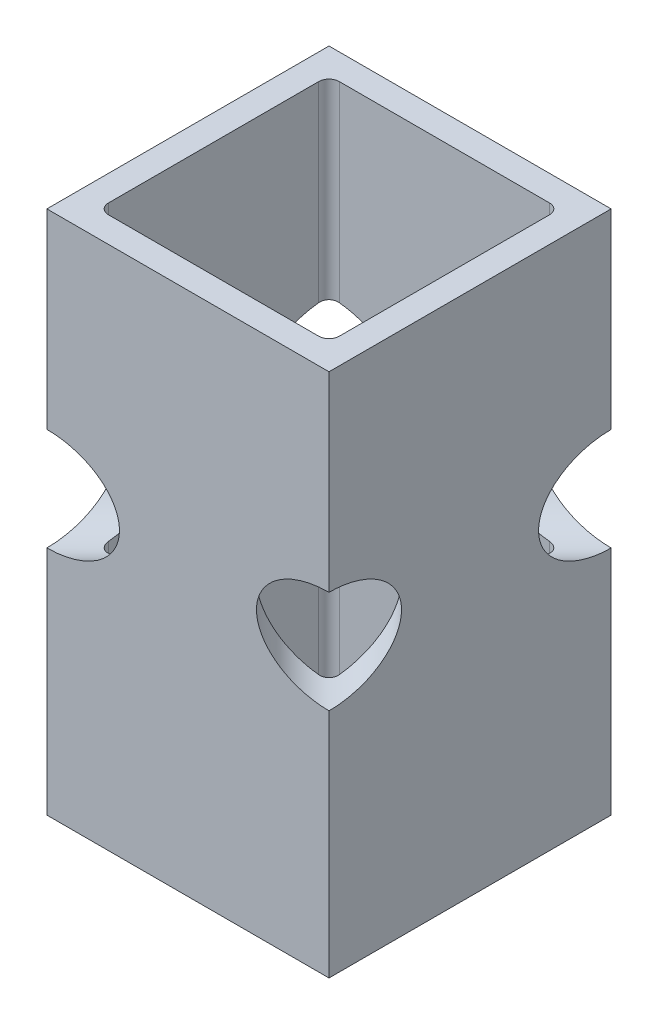
ISO-10303-21;
HEADER;
FILE_DESCRIPTION(('STEP AP214'),'2;1');
FILE_NAME('part.step','',(''),(''),'','','');
FILE_SCHEMA(('AUTOMOTIVE_DESIGN { 1 0 10303 214 1 1 1 1 }'));
ENDSEC;
DATA;
#1=APPLICATION_CONTEXT('core data for automotive mechanical design processes');
#2=APPLICATION_PROTOCOL_DEFINITION('international standard','automotive_design',2000,#1);
#3=PRODUCT_CONTEXT('',#1,'mechanical');
#4=PRODUCT('Part','Part','',(#3));
#5=PRODUCT_RELATED_PRODUCT_CATEGORY('part','',(#4));
#6=PRODUCT_DEFINITION_FORMATION('','',#4);
#7=PRODUCT_DEFINITION_CONTEXT('part definition',#1,'design');
#8=PRODUCT_DEFINITION('design','',#6,#7);
#9=PRODUCT_DEFINITION_SHAPE('','',#8);
#10=(LENGTH_UNIT() NAMED_UNIT(*) SI_UNIT(.MILLI.,.METRE.));
#11=(NAMED_UNIT(*) PLANE_ANGLE_UNIT() SI_UNIT($,.RADIAN.));
#12=(NAMED_UNIT(*) SI_UNIT($,.STERADIAN.) SOLID_ANGLE_UNIT());
#13=UNCERTAINTY_MEASURE_WITH_UNIT(LENGTH_MEASURE(1.E-05),#10,'distance_accuracy_value','');
#14=(GEOMETRIC_REPRESENTATION_CONTEXT(3) GLOBAL_UNCERTAINTY_ASSIGNED_CONTEXT((#13)) GLOBAL_UNIT_ASSIGNED_CONTEXT((#10,
#11,#12)) REPRESENTATION_CONTEXT('',''));
#15=CARTESIAN_POINT('',(0.,0.,0.));
#16=DIRECTION('',(0.,0.,1.));
#17=DIRECTION('',(1.,0.,0.));
#18=AXIS2_PLACEMENT_3D('',#15,#16,#17);
#19=CARTESIAN_POINT('',(13.0175,65.,13.0175));
#20=DIRECTION('',(0.,1.,0.));
#21=DIRECTION('',(0.,0.,1.));
#22=AXIS2_PLACEMENT_3D('',#19,#20,#21);
#23=CYLINDRICAL_SURFACE('',#22,1.27);
#24=DIRECTION('',(0.,-1.,0.));
#25=VECTOR('',#24,1.);
#26=CARTESIAN_POINT('',(14.2875,65.,13.0175));
#27=LINE('',#26,#25);
#28=CARTESIAN_POINT('',(14.2875,41.2861792847484,13.0175));
#29=VERTEX_POINT('',#28);
#30=CARTESIAN_POINT('',(14.2875,65.,13.0175));
#31=VERTEX_POINT('',#30);
#32=EDGE_CURVE('E259',#29,#31,#27,.F.);
#33=ORIENTED_EDGE('',*,*,#32,.F.);
#34=CARTESIAN_POINT('',(14.2875,41.2861792847484,13.0175));
#35=CARTESIAN_POINT('',(14.2874992650252,41.2897753053756,13.053097915007));
#36=CARTESIAN_POINT('',(14.2860023741304,41.2933662752337,13.0886794350228));
#37=CARTESIAN_POINT('',(14.2800272231778,41.3004426344767,13.1596024855031));
#38=CARTESIAN_POINT('',(14.2755488986464,41.3039280215768,13.194944010761));
#39=CARTESIAN_POINT('',(14.257669029886,41.3140762505206,13.3002322041436));
#40=CARTESIAN_POINT('',(14.2398225448024,41.3204379822199,13.3695073681853));
#41=CARTESIAN_POINT('',(14.1927035864845,41.3316400183867,13.5042229008832));
#42=CARTESIAN_POINT('',(14.1634211945816,41.3364789955315,13.5696598837603));
#43=CARTESIAN_POINT('',(14.0942210454631,41.3440868410946,13.6947552121595));
#44=CARTESIAN_POINT('',(14.0543085199653,41.3468567252913,13.7544163806604));
#45=CARTESIAN_POINT('',(13.9655438158698,41.3499943278115,13.8655006465901));
#46=CARTESIAN_POINT('',(13.9168109876824,41.3503919614329,13.9170183252224));
#47=CARTESIAN_POINT('',(13.811471668528,41.3488208732778,14.0112312214346));
#48=CARTESIAN_POINT('',(13.7548638613512,41.3468517555054,14.053924961226));
#49=CARTESIAN_POINT('',(13.6359198442812,41.340791069684,14.1289695479802));
#50=CARTESIAN_POINT('',(13.5736334334685,41.3367167205146,14.1614009134513));
#51=CARTESIAN_POINT('',(13.4446928552833,41.3268960472698,14.2155361933771));
#52=CARTESIAN_POINT('',(13.3780400684717,41.321150249715,14.2372434802069));
#53=CARTESIAN_POINT('',(13.2621705153789,41.3104491947401,14.2646850359202));
#54=CARTESIAN_POINT('',(13.2135758489815,41.3057566257393,14.273237165521));
#55=CARTESIAN_POINT('',(13.1158258334415,41.2961059503237,14.2846436569724));
#56=CARTESIAN_POINT('',(13.0666714774751,41.2911482696659,14.2875068885268));
#57=CARTESIAN_POINT('',(13.0175,41.2861792847484,14.2875));
#58=B_SPLINE_CURVE_WITH_KNOTS('',3,(#34,#35,#36,#37,#38,#39,#40,#41,#42,#43,#44,#45,#46,#47,#48,
#49,#50,#51,#52,#53,#54,#55,#56,#57),.UNSPECIFIED.,.F.,.F.,(4,2,2,2,2,2,2,2,2,2,2,4),(0.,
0.107272353476896,0.214547026794335,0.428903122119667,0.64344554860997,0.85788258057257,
1.06960963742599,1.28137212457303,1.49142937798506,1.70142053308292,1.84979912914096,
1.99794620229393),.UNSPECIFIED.);
#59=CARTESIAN_POINT('',(13.0175,41.2861792847484,14.2875));
#60=VERTEX_POINT('',#59);
#61=EDGE_CURVE('E451',#29,#60,#58,.T.);
#62=ORIENTED_EDGE('',*,*,#61,.T.);
#63=DIRECTION('',(0.,-1.,0.));
#64=VECTOR('',#63,1.);
#65=CARTESIAN_POINT('',(13.0175,0.,14.2875));
#66=LINE('',#65,#64);
#67=CARTESIAN_POINT('',(13.0175,65.,14.2875));
#68=VERTEX_POINT('',#67);
#69=EDGE_CURVE('E251',#68,#60,#66,.T.);
#70=ORIENTED_EDGE('',*,*,#69,.F.);
#71=CARTESIAN_POINT('',(13.0175,65.,13.0175));
#72=DIRECTION('',(0.,1.,0.));
#73=DIRECTION('',(0.,0.,1.));
#74=AXIS2_PLACEMENT_3D('',#71,#72,#73);
#75=CIRCLE('',#74,1.27);
#76=EDGE_CURVE('E282',#31,#68,#75,.F.);
#77=ORIENTED_EDGE('',*,*,#76,.F.);
#78=EDGE_LOOP('',(#33,#62,#70,#77));
#79=FACE_BOUND('',#78,.T.);
#80=ADVANCED_FACE('F41',(#79),#23,.F.);
#81=CARTESIAN_POINT('',(-13.0175,65.,-13.0175));
#82=DIRECTION('',(0.,1.,0.));
#83=DIRECTION('',(0.,0.,1.));
#84=AXIS2_PLACEMENT_3D('',#81,#82,#83);
#85=CYLINDRICAL_SURFACE('',#84,1.27);
#86=DIRECTION('',(0.,-1.,0.));
#87=VECTOR('',#86,1.);
#88=CARTESIAN_POINT('',(-14.2875,65.,-13.0175));
#89=LINE('',#88,#87);
#90=CARTESIAN_POINT('',(-14.2875,41.2861792847484,-13.0175));
#91=VERTEX_POINT('',#90);
#92=CARTESIAN_POINT('',(-14.2875,65.,-13.0175));
#93=VERTEX_POINT('',#92);
#94=EDGE_CURVE('E263',#91,#93,#89,.F.);
#95=ORIENTED_EDGE('',*,*,#94,.F.);
#96=CARTESIAN_POINT('',(-14.2875,41.2861792847484,-13.0175));
#97=CARTESIAN_POINT('',(-14.2874992650252,41.2897753053756,-13.053097915007));
#98=CARTESIAN_POINT('',(-14.2860023741304,41.2933662752337,-13.0886794350228));
#99=CARTESIAN_POINT('',(-14.2800272231778,41.3004426344767,-13.1596024855031));
#100=CARTESIAN_POINT('',(-14.2755488986464,41.3039280215768,-13.194944010761));
#101=CARTESIAN_POINT('',(-14.257669029886,41.3140762505206,-13.3002322041436));
#102=CARTESIAN_POINT('',(-14.2398225448024,41.3204379822199,-13.3695073681853));
#103=CARTESIAN_POINT('',(-14.1927035864845,41.3316400183867,-13.5042229008832));
#104=CARTESIAN_POINT('',(-14.1634211945816,41.3364789955315,-13.5696598837603));
#105=CARTESIAN_POINT('',(-14.0942210454631,41.3440868410946,-13.6947552121595));
#106=CARTESIAN_POINT('',(-14.0543085199653,41.3468567252913,-13.7544163806604));
#107=CARTESIAN_POINT('',(-13.9655438158698,41.3499943278115,-13.8655006465901));
#108=CARTESIAN_POINT('',(-13.9168109876824,41.3503919614329,-13.9170183252224));
#109=CARTESIAN_POINT('',(-13.811471668528,41.3488208732778,-14.0112312214346));
#110=CARTESIAN_POINT('',(-13.7548638613512,41.3468517555054,-14.053924961226));
#111=CARTESIAN_POINT('',(-13.6359198442812,41.340791069684,-14.1289695479802));
#112=CARTESIAN_POINT('',(-13.5736334334685,41.3367167205146,-14.1614009134513));
#113=CARTESIAN_POINT('',(-13.4446928552833,41.3268960472698,-14.2155361933771));
#114=CARTESIAN_POINT('',(-13.3780400684717,41.321150249715,-14.2372434802069));
#115=CARTESIAN_POINT('',(-13.2621705153789,41.3104491947401,-14.2646850359202));
#116=CARTESIAN_POINT('',(-13.2135758489815,41.3057566257393,-14.273237165521));
#117=CARTESIAN_POINT('',(-13.1158258334415,41.2961059503237,-14.2846436569724));
#118=CARTESIAN_POINT('',(-13.0666714774751,41.2911482696659,-14.2875068885268));
#119=CARTESIAN_POINT('',(-13.0175,41.2861792847484,-14.2875));
#120=B_SPLINE_CURVE_WITH_KNOTS('',3,(#96,#97,#98,#99,#100,#101,#102,#103,#104,#105,#106,#107,
#108,#109,#110,#111,#112,#113,#114,#115,#116,#117,#118,#119),.UNSPECIFIED.,.F.,.F.,(4,2,2,2,2,2,
2,2,2,2,2,4),(0.,0.107272353476896,0.214547026794335,0.428903122119667,0.643445548609971,
0.85788258057257,1.06960963742599,1.28137212457303,1.49142937798506,1.70142053308292,
1.84979912914096,1.99794620229393),.UNSPECIFIED.);
#121=CARTESIAN_POINT('',(-13.0175,41.2861792847484,-14.2875));
#122=VERTEX_POINT('',#121);
#123=EDGE_CURVE('E11',#91,#122,#120,.T.);
#124=ORIENTED_EDGE('',*,*,#123,.T.);
#125=DIRECTION('',(0.,-1.,0.));
#126=VECTOR('',#125,1.);
#127=CARTESIAN_POINT('',(-13.0175,0.,-14.2875));
#128=LINE('',#127,#126);
#129=CARTESIAN_POINT('',(-13.0175,65.,-14.2875));
#130=VERTEX_POINT('',#129);
#131=EDGE_CURVE('E277',#130,#122,#128,.T.);
#132=ORIENTED_EDGE('',*,*,#131,.F.);
#133=CARTESIAN_POINT('',(-13.0175,65.,-13.0175));
#134=DIRECTION('',(0.,1.,0.));
#135=DIRECTION('',(0.,0.,1.));
#136=AXIS2_PLACEMENT_3D('',#133,#134,#135);
#137=CIRCLE('',#136,1.27);
#138=EDGE_CURVE('E292',#93,#130,#137,.F.);
#139=ORIENTED_EDGE('',*,*,#138,.F.);
#140=EDGE_LOOP('',(#95,#124,#132,#139));
#141=FACE_BOUND('',#140,.T.);
#142=ADVANCED_FACE('F541',(#141),#85,.F.);
#143=CARTESIAN_POINT('',(-13.0175,65.,13.0175));
#144=DIRECTION('',(0.,-1.,0.));
#145=DIRECTION('',(0.,0.,-1.));
#146=AXIS2_PLACEMENT_3D('',#143,#144,#145);
#147=CYLINDRICAL_SURFACE('',#146,1.27);
#148=DIRECTION('',(0.,-1.,0.));
#149=VECTOR('',#148,1.);
#150=CARTESIAN_POINT('',(-14.2875,65.,13.0175));
#151=LINE('',#150,#149);
#152=CARTESIAN_POINT('',(-14.2875,28.7138207152516,13.0175));
#153=VERTEX_POINT('',#152);
#154=CARTESIAN_POINT('',(-14.2875,0.,13.0175));
#155=VERTEX_POINT('',#154);
#156=EDGE_CURVE('E267',#153,#155,#151,.T.);
#157=ORIENTED_EDGE('',*,*,#156,.F.);
#158=CARTESIAN_POINT('',(-14.2875,28.7138207152516,13.0175));
#159=CARTESIAN_POINT('',(-14.2874992650252,28.7102246946244,13.053097915007));
#160=CARTESIAN_POINT('',(-14.2860023741304,28.7066337247663,13.0886794350228));
#161=CARTESIAN_POINT('',(-14.2800272231778,28.6995573655233,13.1596024855031));
#162=CARTESIAN_POINT('',(-14.2755488986464,28.6960719784232,13.194944010761));
#163=CARTESIAN_POINT('',(-14.257669029886,28.6859237494794,13.3002322041436));
#164=CARTESIAN_POINT('',(-14.2398225448024,28.6795620177801,13.3695073681853));
#165=CARTESIAN_POINT('',(-14.1927035864845,28.6683599816133,13.5042229008832));
#166=CARTESIAN_POINT('',(-14.1634211945816,28.6635210044685,13.5696598837603));
#167=CARTESIAN_POINT('',(-14.0942210454631,28.6559131589055,13.6947552121595));
#168=CARTESIAN_POINT('',(-14.0543085199653,28.6531432747087,13.7544163806604));
#169=CARTESIAN_POINT('',(-13.9655438158698,28.6500056721885,13.8655006465902));
#170=CARTESIAN_POINT('',(-13.9168109876824,28.6496080385671,13.9170183252224));
#171=CARTESIAN_POINT('',(-13.811471668528,28.6511791267222,14.0112312214346));
#172=CARTESIAN_POINT('',(-13.7548638613512,28.6531482444946,14.053924961226));
#173=CARTESIAN_POINT('',(-13.6359198442812,28.659208930316,14.1289695479802));
#174=CARTESIAN_POINT('',(-13.5736334334685,28.6632832794854,14.1614009134513));
#175=CARTESIAN_POINT('',(-13.4446928552833,28.6731039527302,14.2155361933771));
#176=CARTESIAN_POINT('',(-13.3780400684717,28.678849750285,14.2372434802069));
#177=CARTESIAN_POINT('',(-13.2621705153789,28.6895508052599,14.2646850359202));
#178=CARTESIAN_POINT('',(-13.2135758489815,28.6942433742607,14.273237165521));
#179=CARTESIAN_POINT('',(-13.1158258334415,28.7038940496763,14.2846436569724));
#180=CARTESIAN_POINT('',(-13.0666714774751,28.7088517303341,14.2875068885268));
#181=CARTESIAN_POINT('',(-13.0175,28.7138207152516,14.2875));
#182=B_SPLINE_CURVE_WITH_KNOTS('',3,(#158,#159,#160,#161,#162,#163,#164,#165,#166,#167,#168,
#169,#170,#171,#172,#173,#174,#175,#176,#177,#178,#179,#180,#181),.UNSPECIFIED.,.F.,.F.,(4,2,2,
2,2,2,2,2,2,2,2,4),(0.,0.107272353476896,0.214547026794334,0.428903122119667,0.643445548609973,
0.857882580572572,1.069609637426,1.28137212457303,1.49142937798506,1.70142053308292,
1.84979912914097,1.99794620229393),.UNSPECIFIED.);
#183=CARTESIAN_POINT('',(-13.0175,28.7138207152516,14.2875));
#184=VERTEX_POINT('',#183);
#185=EDGE_CURVE('E351',#153,#184,#182,.T.);
#186=ORIENTED_EDGE('',*,*,#185,.T.);
#187=DIRECTION('',(0.,-1.,0.));
#188=VECTOR('',#187,1.);
#189=CARTESIAN_POINT('',(-13.0175,65.,14.2875));
#190=LINE('',#189,#188);
#191=CARTESIAN_POINT('',(-13.0175,0.,14.2875));
#192=VERTEX_POINT('',#191);
#193=EDGE_CURVE('E246',#192,#184,#190,.F.);
#194=ORIENTED_EDGE('',*,*,#193,.F.);
#195=CARTESIAN_POINT('',(-13.0175,0.,13.0175));
#196=DIRECTION('',(0.,1.,0.));
#197=DIRECTION('',(0.,0.,1.));
#198=AXIS2_PLACEMENT_3D('',#195,#196,#197);
#199=CIRCLE('',#198,1.27);
#200=EDGE_CURVE('E284',#155,#192,#199,.T.);
#201=ORIENTED_EDGE('',*,*,#200,.F.);
#202=EDGE_LOOP('',(#157,#186,#194,#201));
#203=FACE_BOUND('',#202,.T.);
#204=ADVANCED_FACE('F346',(#203),#147,.F.);
#205=CARTESIAN_POINT('',(13.0175,65.,-13.0175));
#206=DIRECTION('',(0.,-1.,0.));
#207=DIRECTION('',(0.,0.,-1.));
#208=AXIS2_PLACEMENT_3D('',#205,#206,#207);
#209=CYLINDRICAL_SURFACE('',#208,1.27);
#210=DIRECTION('',(0.,-1.,0.));
#211=VECTOR('',#210,1.);
#212=CARTESIAN_POINT('',(14.2875,65.,-13.0175));
#213=LINE('',#212,#211);
#214=CARTESIAN_POINT('',(14.2875,28.7138207152516,-13.0175));
#215=VERTEX_POINT('',#214);
#216=CARTESIAN_POINT('',(14.2875,0.,-13.0175));
#217=VERTEX_POINT('',#216);
#218=EDGE_CURVE('E255',#215,#217,#213,.T.);
#219=ORIENTED_EDGE('',*,*,#218,.F.);
#220=CARTESIAN_POINT('',(14.2875,28.7138207152516,-13.0175));
#221=CARTESIAN_POINT('',(14.2874992650252,28.7102246946244,-13.053097915007));
#222=CARTESIAN_POINT('',(14.2860023741304,28.7066337247663,-13.0886794350228));
#223=CARTESIAN_POINT('',(14.2800272231778,28.6995573655233,-13.1596024855031));
#224=CARTESIAN_POINT('',(14.2755488986464,28.6960719784232,-13.194944010761));
#225=CARTESIAN_POINT('',(14.257669029886,28.6859237494794,-13.3002322041436));
#226=CARTESIAN_POINT('',(14.2398225448024,28.6795620177801,-13.3695073681853));
#227=CARTESIAN_POINT('',(14.1927035864845,28.6683599816133,-13.5042229008832));
#228=CARTESIAN_POINT('',(14.1634211945816,28.6635210044685,-13.5696598837603));
#229=CARTESIAN_POINT('',(14.0942210454631,28.6559131589055,-13.6947552121595));
#230=CARTESIAN_POINT('',(14.0543085199653,28.6531432747087,-13.7544163806604));
#231=CARTESIAN_POINT('',(13.9655438158698,28.6500056721885,-13.8655006465902));
#232=CARTESIAN_POINT('',(13.9168109876824,28.6496080385671,-13.9170183252224));
#233=CARTESIAN_POINT('',(13.811471668528,28.6511791267222,-14.0112312214346));
#234=CARTESIAN_POINT('',(13.7548638613512,28.6531482444946,-14.053924961226));
#235=CARTESIAN_POINT('',(13.6359198442812,28.659208930316,-14.1289695479802));
#236=CARTESIAN_POINT('',(13.5736334334685,28.6632832794854,-14.1614009134513));
#237=CARTESIAN_POINT('',(13.4446928552833,28.6731039527302,-14.2155361933771));
#238=CARTESIAN_POINT('',(13.3780400684717,28.678849750285,-14.2372434802069));
#239=CARTESIAN_POINT('',(13.2621705153789,28.6895508052599,-14.2646850359202));
#240=CARTESIAN_POINT('',(13.2135758489815,28.6942433742607,-14.273237165521));
#241=CARTESIAN_POINT('',(13.1158258334415,28.7038940496763,-14.2846436569724));
#242=CARTESIAN_POINT('',(13.0666714774751,28.7088517303341,-14.2875068885268));
#243=CARTESIAN_POINT('',(13.0175,28.7138207152516,-14.2875));
#244=B_SPLINE_CURVE_WITH_KNOTS('',3,(#220,#221,#222,#223,#224,#225,#226,#227,#228,#229,#230,
#231,#232,#233,#234,#235,#236,#237,#238,#239,#240,#241,#242,#243),.UNSPECIFIED.,.F.,.F.,(4,2,2,
2,2,2,2,2,2,2,2,4),(0.,0.107272353476896,0.214547026794334,0.428903122119667,0.643445548609972,
0.857882580572571,1.06960963742599,1.28137212457303,1.49142937798506,1.70142053308292,
1.84979912914097,1.99794620229393),.UNSPECIFIED.);
#245=CARTESIAN_POINT('',(13.0175,28.7138207152516,-14.2875));
#246=VERTEX_POINT('',#245);
#247=EDGE_CURVE('E306',#215,#246,#244,.T.);
#248=ORIENTED_EDGE('',*,*,#247,.T.);
#249=DIRECTION('',(0.,-1.,0.));
#250=VECTOR('',#249,1.);
#251=CARTESIAN_POINT('',(13.0175,65.,-14.2875));
#252=LINE('',#251,#250);
#253=CARTESIAN_POINT('',(13.0175,0.,-14.2875));
#254=VERTEX_POINT('',#253);
#255=EDGE_CURVE('E273',#254,#246,#252,.F.);
#256=ORIENTED_EDGE('',*,*,#255,.F.);
#257=CARTESIAN_POINT('',(13.0175,0.,-13.0175));
#258=DIRECTION('',(0.,1.,0.));
#259=DIRECTION('',(0.,0.,1.));
#260=AXIS2_PLACEMENT_3D('',#257,#258,#259);
#261=CIRCLE('',#260,1.27);
#262=EDGE_CURVE('E294',#217,#254,#261,.T.);
#263=ORIENTED_EDGE('',*,*,#262,.F.);
#264=EDGE_LOOP('',(#219,#248,#256,#263));
#265=FACE_BOUND('',#264,.T.);
#266=ADVANCED_FACE('F475',(#265),#209,.F.);
#267=CARTESIAN_POINT('',(-14.2875,65.,0.));
#268=DIRECTION('',(1.,0.,0.));
#269=DIRECTION('',(0.,0.,-1.));
#270=AXIS2_PLACEMENT_3D('',#267,#268,#269);
#271=PLANE('',#270);
#272=CARTESIAN_POINT('',(-14.2875,35.,-14.2875));
#273=DIRECTION('',(1.,0.,0.));
#274=DIRECTION('',(0.,0.,1.));
#275=AXIS2_PLACEMENT_3D('',#272,#273,#274);
#276=ELLIPSE('',#275,8.98025612106916,6.35);
#277=CARTESIAN_POINT('',(-14.2875,28.7138207152516,-13.0175));
#278=VERTEX_POINT('',#277);
#279=EDGE_CURVE('E496',#91,#278,#276,.T.);
#280=ORIENTED_EDGE('',*,*,#279,.F.);
#281=ORIENTED_EDGE('',*,*,#94,.T.);
#282=DIRECTION('',(0.,0.,1.));
#283=VECTOR('',#282,1.);
#284=CARTESIAN_POINT('',(-14.2875,65.,0.));
#285=LINE('',#284,#283);
#286=CARTESIAN_POINT('',(-14.2875,65.,13.0175));
#287=VERTEX_POINT('',#286);
#288=EDGE_CURVE('E385',#93,#287,#285,.T.);
#289=ORIENTED_EDGE('',*,*,#288,.T.);
#290=CARTESIAN_POINT('',(-14.2875,41.2861792847484,13.0175));
#291=VERTEX_POINT('',#290);
#292=EDGE_CURVE('E268',#287,#291,#151,.T.);
#293=ORIENTED_EDGE('',*,*,#292,.T.);
#294=CARTESIAN_POINT('',(-14.2875,35.,14.2875));
#295=DIRECTION('',(1.,0.,0.));
#296=DIRECTION('',(0.,0.,1.));
#297=AXIS2_PLACEMENT_3D('',#294,#295,#296);
#298=ELLIPSE('',#297,8.98025612106916,6.35);
#299=EDGE_CURVE('E360',#153,#291,#298,.T.);
#300=ORIENTED_EDGE('',*,*,#299,.F.);
#301=ORIENTED_EDGE('',*,*,#156,.T.);
#302=DIRECTION('',(0.,0.,1.));
#303=VECTOR('',#302,1.);
#304=CARTESIAN_POINT('',(-14.2875,0.,0.));
#305=LINE('',#304,#303);
#306=CARTESIAN_POINT('',(-14.2875,0.,-13.0175));
#307=VERTEX_POINT('',#306);
#308=EDGE_CURVE('E412',#307,#155,#305,.T.);
#309=ORIENTED_EDGE('',*,*,#308,.F.);
#310=EDGE_CURVE('E264',#307,#278,#89,.F.);
#311=ORIENTED_EDGE('',*,*,#310,.T.);
#312=EDGE_LOOP('',(#280,#281,#289,#293,#300,#301,#309,#311));
#313=FACE_BOUND('',#312,.T.);
#314=ADVANCED_FACE('F530',(#313),#271,.T.);
#315=CARTESIAN_POINT('',(0.,65.,-14.2875));
#316=DIRECTION('',(0.,0.,1.));
#317=DIRECTION('',(1.,0.,0.));
#318=AXIS2_PLACEMENT_3D('',#315,#316,#317);
#319=PLANE('',#318);
#320=CARTESIAN_POINT('',(-14.2875,35.,-14.2875));
#321=DIRECTION('',(0.,0.,1.));
#322=DIRECTION('',(1.,0.,0.));
#323=AXIS2_PLACEMENT_3D('',#320,#321,#322);
#324=ELLIPSE('',#323,8.98025612106916,6.35);
#325=CARTESIAN_POINT('',(-13.0175,28.7138207152516,-14.2875));
#326=VERTEX_POINT('',#325);
#327=EDGE_CURVE('E499',#326,#122,#324,.T.);
#328=ORIENTED_EDGE('',*,*,#327,.F.);
#329=CARTESIAN_POINT('',(-13.0175,0.,-14.2875));
#330=VERTEX_POINT('',#329);
#331=EDGE_CURVE('E276',#326,#330,#128,.T.);
#332=ORIENTED_EDGE('',*,*,#331,.T.);
#333=DIRECTION('',(-1.,0.,0.));
#334=VECTOR('',#333,1.);
#335=CARTESIAN_POINT('',(0.,0.,-14.2875));
#336=LINE('',#335,#334);
#337=EDGE_CURVE('E416',#254,#330,#336,.T.);
#338=ORIENTED_EDGE('',*,*,#337,.F.);
#339=ORIENTED_EDGE('',*,*,#255,.T.);
#340=CARTESIAN_POINT('',(14.2875,35.,-14.2875));
#341=DIRECTION('',(0.,0.,1.));
#342=DIRECTION('',(-1.,0.,0.));
#343=AXIS2_PLACEMENT_3D('',#340,#341,#342);
#344=ELLIPSE('',#343,8.98025612106916,6.35);
#345=CARTESIAN_POINT('',(13.0175,41.2861792847484,-14.2875));
#346=VERTEX_POINT('',#345);
#347=EDGE_CURVE('E336',#346,#246,#344,.T.);
#348=ORIENTED_EDGE('',*,*,#347,.F.);
#349=CARTESIAN_POINT('',(13.0175,65.,-14.2875));
#350=VERTEX_POINT('',#349);
#351=EDGE_CURVE('E272',#346,#350,#252,.F.);
#352=ORIENTED_EDGE('',*,*,#351,.T.);
#353=DIRECTION('',(-1.,0.,0.));
#354=VECTOR('',#353,1.);
#355=CARTESIAN_POINT('',(0.,65.,-14.2875));
#356=LINE('',#355,#354);
#357=EDGE_CURVE('E389',#350,#130,#356,.T.);
#358=ORIENTED_EDGE('',*,*,#357,.T.);
#359=ORIENTED_EDGE('',*,*,#131,.T.);
#360=EDGE_LOOP('',(#328,#332,#338,#339,#348,#352,#358,#359));
#361=FACE_BOUND('',#360,.T.);
#362=ADVANCED_FACE('F479',(#361),#319,.T.);
#363=CARTESIAN_POINT('',(14.2875,65.,0.));
#364=DIRECTION('',(1.,0.,0.));
#365=DIRECTION('',(0.,0.,-1.));
#366=AXIS2_PLACEMENT_3D('',#363,#364,#365);
#367=PLANE('',#366);
#368=CARTESIAN_POINT('',(14.2875,0.,13.0175));
#369=VERTEX_POINT('',#368);
#370=CARTESIAN_POINT('',(14.2875,28.7138207152516,13.0175));
#371=VERTEX_POINT('',#370);
#372=EDGE_CURVE('E260',#369,#371,#27,.F.);
#373=ORIENTED_EDGE('',*,*,#372,.T.);
#374=CARTESIAN_POINT('',(14.2875,35.,14.2875));
#375=DIRECTION('',(1.,0.,0.));
#376=DIRECTION('',(0.,0.,1.));
#377=AXIS2_PLACEMENT_3D('',#374,#375,#376);
#378=ELLIPSE('',#377,8.98025612106916,6.35);
#379=EDGE_CURVE('E458',#371,#29,#378,.T.);
#380=ORIENTED_EDGE('',*,*,#379,.T.);
#381=ORIENTED_EDGE('',*,*,#32,.T.);
#382=DIRECTION('',(0.,0.,1.));
#383=VECTOR('',#382,1.);
#384=CARTESIAN_POINT('',(14.2875,65.,0.));
#385=LINE('',#384,#383);
#386=CARTESIAN_POINT('',(14.2875,65.,-13.0175));
#387=VERTEX_POINT('',#386);
#388=EDGE_CURVE('E392',#387,#31,#385,.T.);
#389=ORIENTED_EDGE('',*,*,#388,.F.);
#390=CARTESIAN_POINT('',(14.2875,41.2861792847484,-13.0175));
#391=VERTEX_POINT('',#390);
#392=EDGE_CURVE('E256',#387,#391,#213,.T.);
#393=ORIENTED_EDGE('',*,*,#392,.T.);
#394=CARTESIAN_POINT('',(14.2875,35.,-14.2875));
#395=DIRECTION('',(1.,0.,0.));
#396=DIRECTION('',(0.,0.,1.));
#397=AXIS2_PLACEMENT_3D('',#394,#395,#396);
#398=ELLIPSE('',#397,8.98025612106916,6.35);
#399=EDGE_CURVE('E231',#391,#215,#398,.T.);
#400=ORIENTED_EDGE('',*,*,#399,.T.);
#401=ORIENTED_EDGE('',*,*,#218,.T.);
#402=DIRECTION('',(0.,0.,1.));
#403=VECTOR('',#402,1.);
#404=CARTESIAN_POINT('',(14.2875,0.,0.));
#405=LINE('',#404,#403);
#406=EDGE_CURVE('E419',#217,#369,#405,.T.);
#407=ORIENTED_EDGE('',*,*,#406,.T.);
#408=EDGE_LOOP('',(#373,#380,#381,#389,#393,#400,#401,#407));
#409=FACE_BOUND('',#408,.T.);
#410=ADVANCED_FACE('F487',(#409),#367,.F.);
#411=CARTESIAN_POINT('',(17.4625,65.,0.));
#412=DIRECTION('',(1.,0.,0.));
#413=DIRECTION('',(0.,0.,-1.));
#414=AXIS2_PLACEMENT_3D('',#411,#412,#413);
#415=PLANE('',#414);
#416=CARTESIAN_POINT('',(17.4625,35.,17.4625));
#417=DIRECTION('',(1.,0.,0.));
#418=DIRECTION('',(0.,0.,1.));
#419=AXIS2_PLACEMENT_3D('',#416,#417,#418);
#420=ELLIPSE('',#419,8.98025612106916,6.35);
#421=CARTESIAN_POINT('',(17.4625,28.65,17.4625));
#422=VERTEX_POINT('',#421);
#423=CARTESIAN_POINT('',(17.4625,41.35,17.4625));
#424=VERTEX_POINT('',#423);
#425=EDGE_CURVE('E68',#422,#424,#420,.T.);
#426=ORIENTED_EDGE('',*,*,#425,.F.);
#427=DIRECTION('',(0.,-1.,0.));
#428=VECTOR('',#427,1.);
#429=CARTESIAN_POINT('',(17.4625,65.,17.4625));
#430=LINE('',#429,#428);
#431=CARTESIAN_POINT('',(17.4625,0.,17.4625));
#432=VERTEX_POINT('',#431);
#433=EDGE_CURVE('E399',#422,#432,#430,.T.);
#434=ORIENTED_EDGE('',*,*,#433,.T.);
#435=DIRECTION('',(0.,0.,1.));
#436=VECTOR('',#435,1.);
#437=CARTESIAN_POINT('',(17.4625,0.,0.));
#438=LINE('',#437,#436);
#439=CARTESIAN_POINT('',(17.4625,0.,-17.4625));
#440=VERTEX_POINT('',#439);
#441=EDGE_CURVE('E372',#440,#432,#438,.T.);
#442=ORIENTED_EDGE('',*,*,#441,.F.);
#443=DIRECTION('',(0.,-1.,0.));
#444=VECTOR('',#443,1.);
#445=CARTESIAN_POINT('',(17.4625,65.,-17.4625));
#446=LINE('',#445,#444);
#447=CARTESIAN_POINT('',(17.4625,28.65,-17.4625));
#448=VERTEX_POINT('',#447);
#449=EDGE_CURVE('E236',#448,#440,#446,.T.);
#450=ORIENTED_EDGE('',*,*,#449,.F.);
#451=CARTESIAN_POINT('',(17.4625,35.,-17.4625));
#452=DIRECTION('',(1.,0.,0.));
#453=DIRECTION('',(0.,0.,1.));
#454=AXIS2_PLACEMENT_3D('',#451,#452,#453);
#455=ELLIPSE('',#454,8.98025612106916,6.35);
#456=CARTESIAN_POINT('',(17.4625,41.35,-17.4625));
#457=VERTEX_POINT('',#456);
#458=EDGE_CURVE('E370',#457,#448,#455,.T.);
#459=ORIENTED_EDGE('',*,*,#458,.F.);
#460=CARTESIAN_POINT('',(17.4625,65.,-17.4625));
#461=VERTEX_POINT('',#460);
#462=EDGE_CURVE('E238',#461,#457,#446,.T.);
#463=ORIENTED_EDGE('',*,*,#462,.F.);
#464=DIRECTION('',(0.,0.,1.));
#465=VECTOR('',#464,1.);
#466=CARTESIAN_POINT('',(17.4625,65.,0.));
#467=LINE('',#466,#465);
#468=CARTESIAN_POINT('',(17.4625,65.,17.4625));
#469=VERTEX_POINT('',#468);
#470=EDGE_CURVE('E373',#461,#469,#467,.T.);
#471=ORIENTED_EDGE('',*,*,#470,.T.);
#472=EDGE_CURVE('E424',#469,#424,#430,.T.);
#473=ORIENTED_EDGE('',*,*,#472,.T.);
#474=EDGE_LOOP('',(#426,#434,#442,#450,#459,#463,#471,#473));
#475=FACE_BOUND('',#474,.T.);
#476=ADVANCED_FACE('F431',(#475),#415,.T.);
#477=CARTESIAN_POINT('',(0.,65.,-17.4625));
#478=DIRECTION('',(0.,0.,1.));
#479=DIRECTION('',(1.,0.,0.));
#480=AXIS2_PLACEMENT_3D('',#477,#478,#479);
#481=PLANE('',#480);
#482=DIRECTION('',(0.,-1.,0.));
#483=VECTOR('',#482,1.);
#484=CARTESIAN_POINT('',(-17.4625,65.,-17.4625));
#485=LINE('',#484,#483);
#486=CARTESIAN_POINT('',(-17.4625,28.65,-17.4625));
#487=VERTEX_POINT('',#486);
#488=CARTESIAN_POINT('',(-17.4625,0.,-17.4625));
#489=VERTEX_POINT('',#488);
#490=EDGE_CURVE('E230',#487,#489,#485,.T.);
#491=ORIENTED_EDGE('',*,*,#490,.F.);
#492=CARTESIAN_POINT('',(-17.4625,35.,-17.4625));
#493=DIRECTION('',(0.,0.,1.));
#494=DIRECTION('',(1.,0.,0.));
#495=AXIS2_PLACEMENT_3D('',#492,#493,#494);
#496=ELLIPSE('',#495,8.98025612106916,6.35);
#497=CARTESIAN_POINT('',(-17.4625,41.35,-17.4625));
#498=VERTEX_POINT('',#497);
#499=EDGE_CURVE('E61',#487,#498,#496,.T.);
#500=ORIENTED_EDGE('',*,*,#499,.T.);
#501=CARTESIAN_POINT('',(-17.4625,65.,-17.4625));
#502=VERTEX_POINT('',#501);
#503=EDGE_CURVE('E227',#502,#498,#485,.T.);
#504=ORIENTED_EDGE('',*,*,#503,.F.);
#505=DIRECTION('',(-1.,0.,0.));
#506=VECTOR('',#505,1.);
#507=CARTESIAN_POINT('',(0.,65.,-17.4625));
#508=LINE('',#507,#506);
#509=EDGE_CURVE('E376',#461,#502,#508,.T.);
#510=ORIENTED_EDGE('',*,*,#509,.F.);
#511=ORIENTED_EDGE('',*,*,#462,.T.);
#512=CARTESIAN_POINT('',(17.4625,35.,-17.4625));
#513=DIRECTION('',(0.,0.,1.));
#514=DIRECTION('',(-1.,0.,0.));
#515=AXIS2_PLACEMENT_3D('',#512,#513,#514);
#516=ELLIPSE('',#515,8.98025612106916,6.35);
#517=EDGE_CURVE('E367',#457,#448,#516,.T.);
#518=ORIENTED_EDGE('',*,*,#517,.T.);
#519=ORIENTED_EDGE('',*,*,#449,.T.);
#520=DIRECTION('',(-1.,0.,0.));
#521=VECTOR('',#520,1.);
#522=CARTESIAN_POINT('',(0.,0.,-17.4625));
#523=LINE('',#522,#521);
#524=EDGE_CURVE('E403',#440,#489,#523,.T.);
#525=ORIENTED_EDGE('',*,*,#524,.T.);
#526=EDGE_LOOP('',(#491,#500,#504,#510,#511,#518,#519,#525));
#527=FACE_BOUND('',#526,.T.);
#528=ADVANCED_FACE('F225',(#527),#481,.F.);
#529=CARTESIAN_POINT('',(-17.4625,65.,0.));
#530=DIRECTION('',(1.,0.,0.));
#531=DIRECTION('',(0.,0.,-1.));
#532=AXIS2_PLACEMENT_3D('',#529,#530,#531);
#533=PLANE('',#532);
#534=ORIENTED_EDGE('',*,*,#503,.T.);
#535=CARTESIAN_POINT('',(-17.4625,35.,-17.4625));
#536=DIRECTION('',(1.,0.,0.));
#537=DIRECTION('',(0.,0.,1.));
#538=AXIS2_PLACEMENT_3D('',#535,#536,#537);
#539=ELLIPSE('',#538,8.98025612106916,6.35);
#540=EDGE_CURVE('E217',#498,#487,#539,.T.);
#541=ORIENTED_EDGE('',*,*,#540,.T.);
#542=ORIENTED_EDGE('',*,*,#490,.T.);
#543=DIRECTION('',(0.,0.,1.));
#544=VECTOR('',#543,1.);
#545=CARTESIAN_POINT('',(-17.4625,0.,0.));
#546=LINE('',#545,#544);
#547=CARTESIAN_POINT('',(-17.4625,0.,17.4625));
#548=VERTEX_POINT('',#547);
#549=EDGE_CURVE('E405',#489,#548,#546,.T.);
#550=ORIENTED_EDGE('',*,*,#549,.T.);
#551=DIRECTION('',(0.,-1.,0.));
#552=VECTOR('',#551,1.);
#553=CARTESIAN_POINT('',(-17.4625,65.,17.4625));
#554=LINE('',#553,#552);
#555=CARTESIAN_POINT('',(-17.4625,28.65,17.4625));
#556=VERTEX_POINT('',#555);
#557=EDGE_CURVE('E426',#556,#548,#554,.T.);
#558=ORIENTED_EDGE('',*,*,#557,.F.);
#559=CARTESIAN_POINT('',(-17.4625,35.,17.4625));
#560=DIRECTION('',(1.,0.,0.));
#561=DIRECTION('',(0.,0.,1.));
#562=AXIS2_PLACEMENT_3D('',#559,#560,#561);
#563=ELLIPSE('',#562,8.98025612106916,6.35);
#564=CARTESIAN_POINT('',(-17.4625,41.35,17.4625));
#565=VERTEX_POINT('',#564);
#566=EDGE_CURVE('E363',#556,#565,#563,.T.);
#567=ORIENTED_EDGE('',*,*,#566,.T.);
#568=CARTESIAN_POINT('',(-17.4625,65.,17.4625));
#569=VERTEX_POINT('',#568);
#570=EDGE_CURVE('E240',#569,#565,#554,.T.);
#571=ORIENTED_EDGE('',*,*,#570,.F.);
#572=DIRECTION('',(0.,0.,1.));
#573=VECTOR('',#572,1.);
#574=CARTESIAN_POINT('',(-17.4625,65.,0.));
#575=LINE('',#574,#573);
#576=EDGE_CURVE('E235',#502,#569,#575,.T.);
#577=ORIENTED_EDGE('',*,*,#576,.F.);
#578=EDGE_LOOP('',(#534,#541,#542,#550,#558,#567,#571,#577));
#579=FACE_BOUND('',#578,.T.);
#580=ADVANCED_FACE('F233',(#579),#533,.F.);
#581=CARTESIAN_POINT('',(0.,65.,17.4625));
#582=DIRECTION('',(0.,0.,1.));
#583=DIRECTION('',(1.,0.,0.));
#584=AXIS2_PLACEMENT_3D('',#581,#582,#583);
#585=PLANE('',#584);
#586=CARTESIAN_POINT('',(17.4625,35.,17.4625));
#587=DIRECTION('',(0.,0.,1.));
#588=DIRECTION('',(1.,0.,0.));
#589=AXIS2_PLACEMENT_3D('',#586,#587,#588);
#590=ELLIPSE('',#589,8.98025612106916,6.35);
#591=EDGE_CURVE('E449',#424,#422,#590,.T.);
#592=ORIENTED_EDGE('',*,*,#591,.F.);
#593=ORIENTED_EDGE('',*,*,#472,.F.);
#594=DIRECTION('',(-1.,0.,0.));
#595=VECTOR('',#594,1.);
#596=CARTESIAN_POINT('',(0.,65.,17.4625));
#597=LINE('',#596,#595);
#598=EDGE_CURVE('E381',#469,#569,#597,.T.);
#599=ORIENTED_EDGE('',*,*,#598,.T.);
#600=ORIENTED_EDGE('',*,*,#570,.T.);
#601=CARTESIAN_POINT('',(-17.4625,35.,17.4625));
#602=DIRECTION('',(0.,0.,1.));
#603=DIRECTION('',(-1.,0.,0.));
#604=AXIS2_PLACEMENT_3D('',#601,#602,#603);
#605=ELLIPSE('',#604,8.98025612106915,6.35);
#606=EDGE_CURVE('E359',#556,#565,#605,.T.);
#607=ORIENTED_EDGE('',*,*,#606,.F.);
#608=ORIENTED_EDGE('',*,*,#557,.T.);
#609=DIRECTION('',(-1.,0.,0.));
#610=VECTOR('',#609,1.);
#611=CARTESIAN_POINT('',(0.,0.,17.4625));
#612=LINE('',#611,#610);
#613=EDGE_CURVE('E409',#432,#548,#612,.T.);
#614=ORIENTED_EDGE('',*,*,#613,.F.);
#615=ORIENTED_EDGE('',*,*,#433,.F.);
#616=EDGE_LOOP('',(#592,#593,#599,#600,#607,#608,#614,#615));
#617=FACE_BOUND('',#616,.T.);
#618=ADVANCED_FACE('F440',(#617),#585,.T.);
#619=CARTESIAN_POINT('',(0.,65.,14.2875));
#620=DIRECTION('',(0.,0.,1.));
#621=DIRECTION('',(1.,0.,0.));
#622=AXIS2_PLACEMENT_3D('',#619,#620,#621);
#623=PLANE('',#622);
#624=ORIENTED_EDGE('',*,*,#69,.T.);
#625=CARTESIAN_POINT('',(14.2875,35.,14.2875));
#626=DIRECTION('',(0.,0.,1.));
#627=DIRECTION('',(1.,0.,0.));
#628=AXIS2_PLACEMENT_3D('',#625,#626,#627);
#629=ELLIPSE('',#628,8.98025612106916,6.35);
#630=CARTESIAN_POINT('',(13.0175,28.7138207152516,14.2875));
#631=VERTEX_POINT('',#630);
#632=EDGE_CURVE('E495',#60,#631,#629,.T.);
#633=ORIENTED_EDGE('',*,*,#632,.T.);
#634=CARTESIAN_POINT('',(13.0175,0.,14.2875));
#635=VERTEX_POINT('',#634);
#636=EDGE_CURVE('E250',#631,#635,#66,.T.);
#637=ORIENTED_EDGE('',*,*,#636,.T.);
#638=DIRECTION('',(-1.,0.,0.));
#639=VECTOR('',#638,1.);
#640=CARTESIAN_POINT('',(0.,0.,14.2875));
#641=LINE('',#640,#639);
#642=EDGE_CURVE('E377',#635,#192,#641,.T.);
#643=ORIENTED_EDGE('',*,*,#642,.T.);
#644=ORIENTED_EDGE('',*,*,#193,.T.);
#645=CARTESIAN_POINT('',(-14.2875,35.,14.2875));
#646=DIRECTION('',(0.,0.,1.));
#647=DIRECTION('',(-1.,0.,0.));
#648=AXIS2_PLACEMENT_3D('',#645,#646,#647);
#649=ELLIPSE('',#648,8.98025612106916,6.35);
#650=CARTESIAN_POINT('',(-13.0175,41.2861792847484,14.2875));
#651=VERTEX_POINT('',#650);
#652=EDGE_CURVE('E335',#184,#651,#649,.T.);
#653=ORIENTED_EDGE('',*,*,#652,.T.);
#654=CARTESIAN_POINT('',(-13.0175,65.,14.2875));
#655=VERTEX_POINT('',#654);
#656=EDGE_CURVE('E245',#651,#655,#190,.F.);
#657=ORIENTED_EDGE('',*,*,#656,.T.);
#658=DIRECTION('',(-1.,0.,0.));
#659=VECTOR('',#658,1.);
#660=CARTESIAN_POINT('',(0.,65.,14.2875));
#661=LINE('',#660,#659);
#662=EDGE_CURVE('E395',#68,#655,#661,.T.);
#663=ORIENTED_EDGE('',*,*,#662,.F.);
#664=EDGE_LOOP('',(#624,#633,#637,#643,#644,#653,#657,#663));
#665=FACE_BOUND('',#664,.T.);
#666=ADVANCED_FACE('F517',(#665),#623,.F.);
#667=CARTESIAN_POINT('',(0.,65.,0.));
#668=DIRECTION('',(0.,1.,0.));
#669=DIRECTION('',(0.,0.,1.));
#670=AXIS2_PLACEMENT_3D('',#667,#668,#669);
#671=PLANE('',#670);
#672=ORIENTED_EDGE('',*,*,#470,.F.);
#673=ORIENTED_EDGE('',*,*,#509,.T.);
#674=ORIENTED_EDGE('',*,*,#576,.T.);
#675=ORIENTED_EDGE('',*,*,#598,.F.);
#676=EDGE_LOOP('',(#672,#673,#674,#675));
#677=FACE_BOUND('',#676,.T.);
#678=ORIENTED_EDGE('',*,*,#288,.F.);
#679=ORIENTED_EDGE('',*,*,#138,.T.);
#680=ORIENTED_EDGE('',*,*,#357,.F.);
#681=CARTESIAN_POINT('',(13.0175,65.,-13.0175));
#682=DIRECTION('',(0.,1.,0.));
#683=DIRECTION('',(0.,0.,1.));
#684=AXIS2_PLACEMENT_3D('',#681,#682,#683);
#685=CIRCLE('',#684,1.27);
#686=EDGE_CURVE('E296',#350,#387,#685,.F.);
#687=ORIENTED_EDGE('',*,*,#686,.T.);
#688=ORIENTED_EDGE('',*,*,#388,.T.);
#689=ORIENTED_EDGE('',*,*,#76,.T.);
#690=ORIENTED_EDGE('',*,*,#662,.T.);
#691=CARTESIAN_POINT('',(-13.0175,65.,13.0175));
#692=DIRECTION('',(0.,1.,0.));
#693=DIRECTION('',(0.,0.,1.));
#694=AXIS2_PLACEMENT_3D('',#691,#692,#693);
#695=CIRCLE('',#694,1.27);
#696=EDGE_CURVE('E287',#655,#287,#695,.F.);
#697=ORIENTED_EDGE('',*,*,#696,.T.);
#698=EDGE_LOOP('',(#678,#679,#680,#687,#688,#689,#690,#697));
#699=FACE_BOUND('',#698,.T.);
#700=ADVANCED_FACE('F318',(#677,#699),#671,.T.);
#701=CARTESIAN_POINT('',(0.,0.,0.));
#702=DIRECTION('',(0.,1.,0.));
#703=DIRECTION('',(0.,0.,1.));
#704=AXIS2_PLACEMENT_3D('',#701,#702,#703);
#705=PLANE('',#704);
#706=ORIENTED_EDGE('',*,*,#441,.T.);
#707=ORIENTED_EDGE('',*,*,#613,.T.);
#708=ORIENTED_EDGE('',*,*,#549,.F.);
#709=ORIENTED_EDGE('',*,*,#524,.F.);
#710=EDGE_LOOP('',(#706,#707,#708,#709));
#711=FACE_BOUND('',#710,.T.);
#712=ORIENTED_EDGE('',*,*,#337,.T.);
#713=CARTESIAN_POINT('',(-13.0175,0.,-13.0175));
#714=DIRECTION('',(0.,1.,0.));
#715=DIRECTION('',(0.,0.,1.));
#716=AXIS2_PLACEMENT_3D('',#713,#714,#715);
#717=CIRCLE('',#716,1.27);
#718=EDGE_CURVE('E290',#330,#307,#717,.T.);
#719=ORIENTED_EDGE('',*,*,#718,.T.);
#720=ORIENTED_EDGE('',*,*,#308,.T.);
#721=ORIENTED_EDGE('',*,*,#200,.T.);
#722=ORIENTED_EDGE('',*,*,#642,.F.);
#723=CARTESIAN_POINT('',(13.0175,0.,13.0175));
#724=DIRECTION('',(0.,1.,0.));
#725=DIRECTION('',(0.,0.,1.));
#726=AXIS2_PLACEMENT_3D('',#723,#724,#725);
#727=CIRCLE('',#726,1.27);
#728=EDGE_CURVE('E280',#635,#369,#727,.T.);
#729=ORIENTED_EDGE('',*,*,#728,.T.);
#730=ORIENTED_EDGE('',*,*,#406,.F.);
#731=ORIENTED_EDGE('',*,*,#262,.T.);
#732=EDGE_LOOP('',(#712,#719,#720,#721,#722,#729,#730,#731));
#733=FACE_BOUND('',#732,.T.);
#734=ADVANCED_FACE('F437',(#711,#733),#705,.F.);
#735=ORIENTED_EDGE('',*,*,#636,.F.);
#736=CARTESIAN_POINT('',(13.0175,28.7138207152516,14.2875));
#737=CARTESIAN_POINT('',(13.053097915007,28.7102246946244,14.2874992650252));
#738=CARTESIAN_POINT('',(13.0886794350228,28.7066337247663,14.2860023741304));
#739=CARTESIAN_POINT('',(13.1596024855031,28.6995573655233,14.2800272231778));
#740=CARTESIAN_POINT('',(13.194944010761,28.6960719784232,14.2755488986464));
#741=CARTESIAN_POINT('',(13.3002322041436,28.6859237494794,14.257669029886));
#742=CARTESIAN_POINT('',(13.3695073681853,28.6795620177801,14.2398225448024));
#743=CARTESIAN_POINT('',(13.5042229008832,28.6683599816133,14.1927035864845));
#744=CARTESIAN_POINT('',(13.5696598837603,28.6635210044685,14.1634211945816));
#745=CARTESIAN_POINT('',(13.6947552121595,28.6559131589055,14.0942210454631));
#746=CARTESIAN_POINT('',(13.7544163806604,28.6531432747087,14.0543085199653));
#747=CARTESIAN_POINT('',(13.8655006465902,28.6500056721885,13.9655438158698));
#748=CARTESIAN_POINT('',(13.9170183252224,28.6496080385671,13.9168109876824));
#749=CARTESIAN_POINT('',(14.0112312214346,28.6511791267222,13.811471668528));
#750=CARTESIAN_POINT('',(14.053924961226,28.6531482444946,13.7548638613512));
#751=CARTESIAN_POINT('',(14.1289695479802,28.659208930316,13.6359198442812));
#752=CARTESIAN_POINT('',(14.1614009134513,28.6632832794854,13.5736334334685));
#753=CARTESIAN_POINT('',(14.2155361933771,28.6731039527302,13.4446928552833));
#754=CARTESIAN_POINT('',(14.2372434802069,28.678849750285,13.3780400684717));
#755=CARTESIAN_POINT('',(14.2646850359202,28.6895508052599,13.2621705153789));
#756=CARTESIAN_POINT('',(14.273237165521,28.6942433742607,13.2135758489815));
#757=CARTESIAN_POINT('',(14.2846436569724,28.7038940496763,13.1158258334415));
#758=CARTESIAN_POINT('',(14.2875068885268,28.7088517303341,13.0666714774751));
#759=CARTESIAN_POINT('',(14.2875,28.7138207152516,13.0175));
#760=B_SPLINE_CURVE_WITH_KNOTS('',3,(#736,#737,#738,#739,#740,#741,#742,#743,#744,#745,#746,
#747,#748,#749,#750,#751,#752,#753,#754,#755,#756,#757,#758,#759),.UNSPECIFIED.,.F.,.F.,(4,2,2,
2,2,2,2,2,2,2,2,4),(0.,0.107272353476895,0.214547026794336,0.428903122119666,0.64344554860997,
0.85788258057257,1.06960963742599,1.28137212457303,1.49142937798505,1.70142053308292,
1.84979912914096,1.99794620229394),.UNSPECIFIED.);
#761=EDGE_CURVE('E492',#631,#371,#760,.T.);
#762=ORIENTED_EDGE('',*,*,#761,.T.);
#763=ORIENTED_EDGE('',*,*,#372,.F.);
#764=ORIENTED_EDGE('',*,*,#728,.F.);
#765=EDGE_LOOP('',(#735,#762,#763,#764));
#766=FACE_BOUND('',#765,.T.);
#767=ADVANCED_FACE('F344',(#766),#23,.F.);
#768=ORIENTED_EDGE('',*,*,#656,.F.);
#769=CARTESIAN_POINT('',(-13.0175,41.2861792847484,14.2875));
#770=CARTESIAN_POINT('',(-13.053097915007,41.2897753053756,14.2874992650252));
#771=CARTESIAN_POINT('',(-13.0886794350228,41.2933662752337,14.2860023741304));
#772=CARTESIAN_POINT('',(-13.1596024855031,41.3004426344767,14.2800272231778));
#773=CARTESIAN_POINT('',(-13.194944010761,41.3039280215768,14.2755488986464));
#774=CARTESIAN_POINT('',(-13.3002322041436,41.3140762505206,14.257669029886));
#775=CARTESIAN_POINT('',(-13.3695073681853,41.3204379822199,14.2398225448024));
#776=CARTESIAN_POINT('',(-13.5042229008832,41.3316400183867,14.1927035864845));
#777=CARTESIAN_POINT('',(-13.5696598837603,41.3364789955315,14.1634211945816));
#778=CARTESIAN_POINT('',(-13.6947552121595,41.3440868410946,14.0942210454631));
#779=CARTESIAN_POINT('',(-13.7544163806604,41.3468567252913,14.0543085199653));
#780=CARTESIAN_POINT('',(-13.8655006465901,41.3499943278115,13.9655438158698));
#781=CARTESIAN_POINT('',(-13.9170183252224,41.3503919614329,13.9168109876824));
#782=CARTESIAN_POINT('',(-14.0112312214346,41.3488208732778,13.811471668528));
#783=CARTESIAN_POINT('',(-14.053924961226,41.3468517555054,13.7548638613512));
#784=CARTESIAN_POINT('',(-14.1289695479802,41.340791069684,13.6359198442812));
#785=CARTESIAN_POINT('',(-14.1614009134513,41.3367167205146,13.5736334334685));
#786=CARTESIAN_POINT('',(-14.2155361933771,41.3268960472698,13.4446928552833));
#787=CARTESIAN_POINT('',(-14.2372434802069,41.321150249715,13.3780400684717));
#788=CARTESIAN_POINT('',(-14.2646850359202,41.3104491947401,13.2621705153789));
#789=CARTESIAN_POINT('',(-14.273237165521,41.3057566257393,13.2135758489815));
#790=CARTESIAN_POINT('',(-14.2846436569724,41.2961059503237,13.1158258334415));
#791=CARTESIAN_POINT('',(-14.2875068885268,41.2911482696659,13.0666714774751));
#792=CARTESIAN_POINT('',(-14.2875,41.2861792847484,13.0175));
#793=B_SPLINE_CURVE_WITH_KNOTS('',3,(#769,#770,#771,#772,#773,#774,#775,#776,#777,#778,#779,
#780,#781,#782,#783,#784,#785,#786,#787,#788,#789,#790,#791,#792),.UNSPECIFIED.,.F.,.F.,(4,2,2,
2,2,2,2,2,2,2,2,4),(0.,0.107272353476896,0.214547026794334,0.428903122119667,0.643445548609971,
0.857882580572569,1.06960963742599,1.28137212457303,1.49142937798505,1.70142053308292,
1.84979912914096,1.99794620229393),.UNSPECIFIED.);
#794=EDGE_CURVE('E325',#651,#291,#793,.T.);
#795=ORIENTED_EDGE('',*,*,#794,.T.);
#796=ORIENTED_EDGE('',*,*,#292,.F.);
#797=ORIENTED_EDGE('',*,*,#696,.F.);
#798=EDGE_LOOP('',(#768,#795,#796,#797));
#799=FACE_BOUND('',#798,.T.);
#800=ADVANCED_FACE('F339',(#799),#147,.F.);
#801=ORIENTED_EDGE('',*,*,#331,.F.);
#802=CARTESIAN_POINT('',(-13.0175,28.7138207152516,-14.2875));
#803=CARTESIAN_POINT('',(-13.053097915007,28.7102246946244,-14.2874992650252));
#804=CARTESIAN_POINT('',(-13.0886794350228,28.7066337247663,-14.2860023741304));
#805=CARTESIAN_POINT('',(-13.1596024855031,28.6995573655233,-14.2800272231778));
#806=CARTESIAN_POINT('',(-13.194944010761,28.6960719784232,-14.2755488986464));
#807=CARTESIAN_POINT('',(-13.3002322041436,28.6859237494794,-14.257669029886));
#808=CARTESIAN_POINT('',(-13.3695073681853,28.6795620177801,-14.2398225448024));
#809=CARTESIAN_POINT('',(-13.5042229008832,28.6683599816133,-14.1927035864845));
#810=CARTESIAN_POINT('',(-13.5696598837603,28.6635210044685,-14.1634211945816));
#811=CARTESIAN_POINT('',(-13.6947552121595,28.6559131589055,-14.0942210454631));
#812=CARTESIAN_POINT('',(-13.7544163806604,28.6531432747087,-14.0543085199653));
#813=CARTESIAN_POINT('',(-13.8655006465901,28.6500056721885,-13.9655438158698));
#814=CARTESIAN_POINT('',(-13.9170183252224,28.6496080385671,-13.9168109876824));
#815=CARTESIAN_POINT('',(-14.0112312214346,28.6511791267222,-13.811471668528));
#816=CARTESIAN_POINT('',(-14.053924961226,28.6531482444946,-13.7548638613512));
#817=CARTESIAN_POINT('',(-14.1289695479802,28.659208930316,-13.6359198442812));
#818=CARTESIAN_POINT('',(-14.1614009134513,28.6632832794854,-13.5736334334685));
#819=CARTESIAN_POINT('',(-14.2155361933771,28.6731039527302,-13.4446928552833));
#820=CARTESIAN_POINT('',(-14.2372434802069,28.678849750285,-13.3780400684717));
#821=CARTESIAN_POINT('',(-14.2646850359202,28.6895508052599,-13.2621705153789));
#822=CARTESIAN_POINT('',(-14.273237165521,28.6942433742607,-13.2135758489815));
#823=CARTESIAN_POINT('',(-14.2846436569724,28.7038940496763,-13.1158258334415));
#824=CARTESIAN_POINT('',(-14.2875068885268,28.7088517303341,-13.0666714774751));
#825=CARTESIAN_POINT('',(-14.2875,28.7138207152516,-13.0175));
#826=B_SPLINE_CURVE_WITH_KNOTS('',3,(#802,#803,#804,#805,#806,#807,#808,#809,#810,#811,#812,
#813,#814,#815,#816,#817,#818,#819,#820,#821,#822,#823,#824,#825),.UNSPECIFIED.,.F.,.F.,(4,2,2,
2,2,2,2,2,2,2,2,4),(0.,0.107272353476897,0.214547026794336,0.428903122119668,0.643445548609973,
0.857882580572573,1.06960963742599,1.28137212457303,1.49142937798506,1.70142053308292,
1.84979912914097,1.99794620229394),.UNSPECIFIED.);
#827=EDGE_CURVE('E55',#326,#278,#826,.T.);
#828=ORIENTED_EDGE('',*,*,#827,.T.);
#829=ORIENTED_EDGE('',*,*,#310,.F.);
#830=ORIENTED_EDGE('',*,*,#718,.F.);
#831=EDGE_LOOP('',(#801,#828,#829,#830));
#832=FACE_BOUND('',#831,.T.);
#833=ADVANCED_FACE('F343',(#832),#85,.F.);
#834=ORIENTED_EDGE('',*,*,#351,.F.);
#835=CARTESIAN_POINT('',(13.0175,41.2861792847484,-14.2875));
#836=CARTESIAN_POINT('',(13.053097915007,41.2897753053756,-14.2874992650252));
#837=CARTESIAN_POINT('',(13.0886794350228,41.2933662752337,-14.2860023741304));
#838=CARTESIAN_POINT('',(13.1596024855031,41.3004426344767,-14.2800272231778));
#839=CARTESIAN_POINT('',(13.194944010761,41.3039280215768,-14.2755488986464));
#840=CARTESIAN_POINT('',(13.3002322041436,41.3140762505206,-14.257669029886));
#841=CARTESIAN_POINT('',(13.3695073681853,41.3204379822199,-14.2398225448024));
#842=CARTESIAN_POINT('',(13.5042229008832,41.3316400183867,-14.1927035864845));
#843=CARTESIAN_POINT('',(13.5696598837603,41.3364789955315,-14.1634211945816));
#844=CARTESIAN_POINT('',(13.6947552121595,41.3440868410946,-14.0942210454631));
#845=CARTESIAN_POINT('',(13.7544163806604,41.3468567252913,-14.0543085199653));
#846=CARTESIAN_POINT('',(13.8655006465901,41.3499943278115,-13.9655438158698));
#847=CARTESIAN_POINT('',(13.9170183252224,41.3503919614329,-13.9168109876824));
#848=CARTESIAN_POINT('',(14.0112312214346,41.3488208732778,-13.811471668528));
#849=CARTESIAN_POINT('',(14.053924961226,41.3468517555054,-13.7548638613512));
#850=CARTESIAN_POINT('',(14.1289695479802,41.340791069684,-13.6359198442812));
#851=CARTESIAN_POINT('',(14.1614009134513,41.3367167205146,-13.5736334334685));
#852=CARTESIAN_POINT('',(14.2155361933771,41.3268960472698,-13.4446928552833));
#853=CARTESIAN_POINT('',(14.2372434802069,41.321150249715,-13.3780400684717));
#854=CARTESIAN_POINT('',(14.2646850359202,41.3104491947401,-13.2621705153789));
#855=CARTESIAN_POINT('',(14.273237165521,41.3057566257393,-13.2135758489815));
#856=CARTESIAN_POINT('',(14.2846436569724,41.2961059503237,-13.1158258334415));
#857=CARTESIAN_POINT('',(14.2875068885268,41.2911482696659,-13.0666714774751));
#858=CARTESIAN_POINT('',(14.2875,41.2861792847484,-13.0175));
#859=B_SPLINE_CURVE_WITH_KNOTS('',3,(#835,#836,#837,#838,#839,#840,#841,#842,#843,#844,#845,
#846,#847,#848,#849,#850,#851,#852,#853,#854,#855,#856,#857,#858),.UNSPECIFIED.,.F.,.F.,(4,2,2,
2,2,2,2,2,2,2,2,4),(0.,0.107272353476894,0.214547026794334,0.428903122119665,0.643445548609969,
0.857882580572569,1.06960963742599,1.28137212457303,1.49142937798505,1.70142053308292,
1.84979912914096,1.99794620229393),.UNSPECIFIED.);
#860=EDGE_CURVE('E298',#346,#391,#859,.T.);
#861=ORIENTED_EDGE('',*,*,#860,.T.);
#862=ORIENTED_EDGE('',*,*,#392,.F.);
#863=ORIENTED_EDGE('',*,*,#686,.F.);
#864=EDGE_LOOP('',(#834,#861,#862,#863));
#865=FACE_BOUND('',#864,.T.);
#866=ADVANCED_FACE('F43',(#865),#209,.F.);
#867=CARTESIAN_POINT('',(17.4625,35.,-17.4625));
#868=DIRECTION('',(-0.707106781186547,0.,0.707106781186548));
#869=DIRECTION('',(0.707106781186548,0.,0.707106781186547));
#870=AXIS2_PLACEMENT_3D('',#867,#868,#869);
#871=CYLINDRICAL_SURFACE('',#870,6.35);
#872=ORIENTED_EDGE('',*,*,#458,.T.);
#873=ORIENTED_EDGE('',*,*,#517,.F.);
#874=EDGE_LOOP('',(#872,#873));
#875=FACE_BOUND('',#874,.T.);
#876=ORIENTED_EDGE('',*,*,#399,.F.);
#877=ORIENTED_EDGE('',*,*,#860,.F.);
#878=ORIENTED_EDGE('',*,*,#347,.T.);
#879=ORIENTED_EDGE('',*,*,#247,.F.);
#880=EDGE_LOOP('',(#876,#877,#878,#879));
#881=FACE_BOUND('',#880,.T.);
#882=ADVANCED_FACE('F311',(#875,#881),#871,.F.);
#883=ORIENTED_EDGE('',*,*,#299,.T.);
#884=ORIENTED_EDGE('',*,*,#794,.F.);
#885=ORIENTED_EDGE('',*,*,#652,.F.);
#886=ORIENTED_EDGE('',*,*,#185,.F.);
#887=EDGE_LOOP('',(#883,#884,#885,#886));
#888=FACE_BOUND('',#887,.T.);
#889=ORIENTED_EDGE('',*,*,#606,.T.);
#890=ORIENTED_EDGE('',*,*,#566,.F.);
#891=EDGE_LOOP('',(#889,#890));
#892=FACE_BOUND('',#891,.T.);
#893=ADVANCED_FACE('F315',(#888,#892),#871,.F.);
#894=CARTESIAN_POINT('',(-17.4625,35.,-17.4625));
#895=DIRECTION('',(0.707106781186548,0.,0.707106781186548));
#896=DIRECTION('',(0.707106781186547,0.,-0.707106781186548));
#897=AXIS2_PLACEMENT_3D('',#894,#895,#896);
#898=CYLINDRICAL_SURFACE('',#897,6.35);
#899=ORIENTED_EDGE('',*,*,#279,.T.);
#900=ORIENTED_EDGE('',*,*,#827,.F.);
#901=ORIENTED_EDGE('',*,*,#327,.T.);
#902=ORIENTED_EDGE('',*,*,#123,.F.);
#903=EDGE_LOOP('',(#899,#900,#901,#902));
#904=FACE_BOUND('',#903,.T.);
#905=ORIENTED_EDGE('',*,*,#540,.F.);
#906=ORIENTED_EDGE('',*,*,#499,.F.);
#907=EDGE_LOOP('',(#905,#906));
#908=FACE_BOUND('',#907,.T.);
#909=ADVANCED_FACE('F218',(#904,#908),#898,.F.);
#910=ORIENTED_EDGE('',*,*,#425,.T.);
#911=ORIENTED_EDGE('',*,*,#591,.T.);
#912=EDGE_LOOP('',(#910,#911));
#913=FACE_BOUND('',#912,.T.);
#914=ORIENTED_EDGE('',*,*,#379,.F.);
#915=ORIENTED_EDGE('',*,*,#761,.F.);
#916=ORIENTED_EDGE('',*,*,#632,.F.);
#917=ORIENTED_EDGE('',*,*,#61,.F.);
#918=EDGE_LOOP('',(#914,#915,#916,#917));
#919=FACE_BOUND('',#918,.T.);
#920=ADVANCED_FACE('F534',(#913,#919),#898,.F.);
#921=CLOSED_SHELL('',(#80,#142,#204,#266,#314,#362,#410,#476,#528,#580,#618,#666,#700,#734,#767,
#800,#833,#866,#882,#893,#909,#920));
#922=MANIFOLD_SOLID_BREP('B2',#921);
#923=ADVANCED_BREP_SHAPE_REPRESENTATION('',(#18,#922),#14);
#924=SHAPE_DEFINITION_REPRESENTATION(#9,#923);
ENDSEC;
END-ISO-10303-21;
